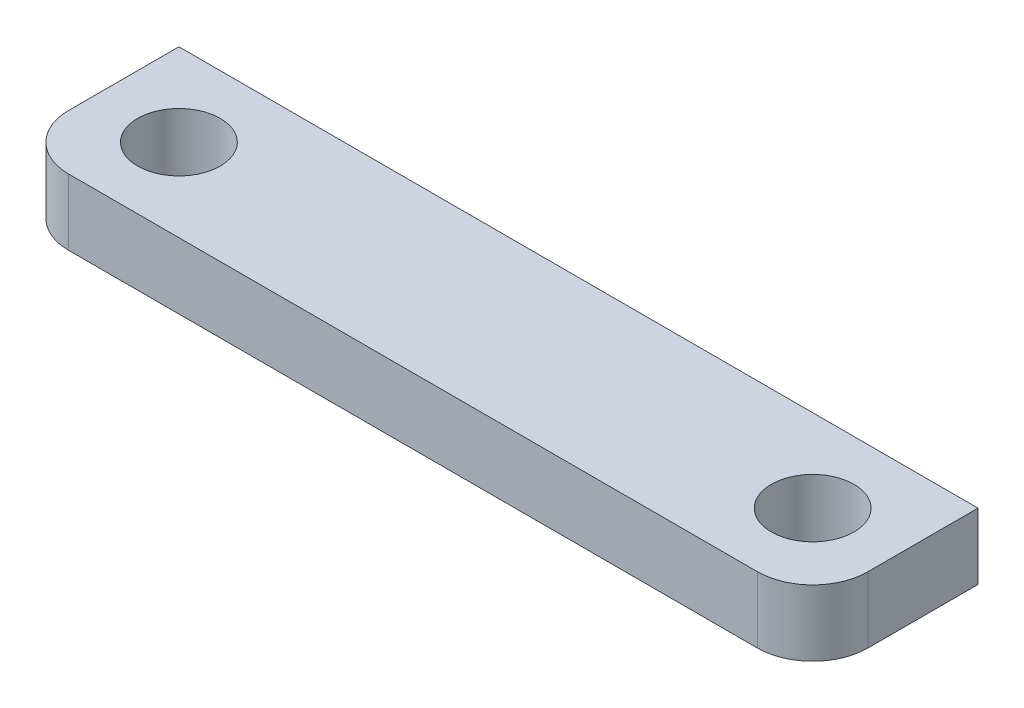
ISO-10303-21;
HEADER;
FILE_DESCRIPTION(('STEP AP214'),'2;1');
FILE_NAME('part.step','',(''),(''),'','','');
FILE_SCHEMA(('AUTOMOTIVE_DESIGN { 1 0 10303 214 1 1 1 1 }'));
ENDSEC;
DATA;
#1=APPLICATION_CONTEXT('core data for automotive mechanical design processes');
#2=APPLICATION_PROTOCOL_DEFINITION('international standard','automotive_design',2000,#1);
#3=PRODUCT_CONTEXT('',#1,'mechanical');
#4=PRODUCT('Part','Part','',(#3));
#5=PRODUCT_RELATED_PRODUCT_CATEGORY('part','',(#4));
#6=PRODUCT_DEFINITION_FORMATION('','',#4);
#7=PRODUCT_DEFINITION_CONTEXT('part definition',#1,'design');
#8=PRODUCT_DEFINITION('design','',#6,#7);
#9=PRODUCT_DEFINITION_SHAPE('','',#8);
#10=(LENGTH_UNIT() NAMED_UNIT(*) SI_UNIT(.MILLI.,.METRE.));
#11=(NAMED_UNIT(*) PLANE_ANGLE_UNIT() SI_UNIT($,.RADIAN.));
#12=(NAMED_UNIT(*) SI_UNIT($,.STERADIAN.) SOLID_ANGLE_UNIT());
#13=UNCERTAINTY_MEASURE_WITH_UNIT(LENGTH_MEASURE(1.E-05),#10,'distance_accuracy_value','');
#14=(GEOMETRIC_REPRESENTATION_CONTEXT(3) GLOBAL_UNCERTAINTY_ASSIGNED_CONTEXT((#13)) GLOBAL_UNIT_ASSIGNED_CONTEXT((#10,
#11,#12)) REPRESENTATION_CONTEXT('',''));
#15=CARTESIAN_POINT('',(0.,0.,0.));
#16=DIRECTION('',(0.,0.,1.));
#17=DIRECTION('',(1.,0.,0.));
#18=AXIS2_PLACEMENT_3D('',#15,#16,#17);
#19=CARTESIAN_POINT('',(29.,2.4,0.));
#20=DIRECTION('',(0.,0.,1.));
#21=DIRECTION('',(1.,0.,0.));
#22=AXIS2_PLACEMENT_3D('',#19,#20,#21);
#23=PLANE('',#22);
#24=DIRECTION('',(-1.,0.,0.));
#25=VECTOR('',#24,1.);
#26=CARTESIAN_POINT('',(29.,0.,0.));
#27=LINE('',#26,#25);
#28=CARTESIAN_POINT('',(29.,0.,0.));
#29=VERTEX_POINT('',#28);
#30=CARTESIAN_POINT('',(0.,0.,0.));
#31=VERTEX_POINT('',#30);
#32=EDGE_CURVE('E106',#29,#31,#27,.T.);
#33=ORIENTED_EDGE('',*,*,#32,.T.);
#34=DIRECTION('',(0.,-1.,0.));
#35=VECTOR('',#34,1.);
#36=CARTESIAN_POINT('',(0.,2.4,0.));
#37=LINE('',#36,#35);
#38=CARTESIAN_POINT('',(0.,2.4,0.));
#39=VERTEX_POINT('',#38);
#40=EDGE_CURVE('E89',#39,#31,#37,.T.);
#41=ORIENTED_EDGE('',*,*,#40,.F.);
#42=DIRECTION('',(-1.,0.,0.));
#43=VECTOR('',#42,1.);
#44=CARTESIAN_POINT('',(29.,2.4,0.));
#45=LINE('',#44,#43);
#46=CARTESIAN_POINT('',(29.,2.4,0.));
#47=VERTEX_POINT('',#46);
#48=EDGE_CURVE('E94',#47,#39,#45,.T.);
#49=ORIENTED_EDGE('',*,*,#48,.F.);
#50=DIRECTION('',(0.,-1.,0.));
#51=VECTOR('',#50,1.);
#52=CARTESIAN_POINT('',(29.,2.4,0.));
#53=LINE('',#52,#51);
#54=EDGE_CURVE('E108',#47,#29,#53,.T.);
#55=ORIENTED_EDGE('',*,*,#54,.T.);
#56=EDGE_LOOP('',(#33,#41,#49,#55));
#57=FACE_BOUND('',#56,.T.);
#58=ADVANCED_FACE('F33',(#57),#23,.F.);
#59=CARTESIAN_POINT('',(0.,2.4,0.));
#60=DIRECTION('',(1.,0.,0.));
#61=DIRECTION('',(0.,0.,-1.));
#62=AXIS2_PLACEMENT_3D('',#59,#60,#61);
#63=PLANE('',#62);
#64=DIRECTION('',(0.,0.,1.));
#65=VECTOR('',#64,1.);
#66=CARTESIAN_POINT('',(0.,0.,0.));
#67=LINE('',#66,#65);
#68=CARTESIAN_POINT('',(0.,0.,3.99999999999999));
#69=VERTEX_POINT('',#68);
#70=EDGE_CURVE('E138',#31,#69,#67,.T.);
#71=ORIENTED_EDGE('',*,*,#70,.T.);
#72=DIRECTION('',(0.,-1.,0.));
#73=VECTOR('',#72,1.);
#74=CARTESIAN_POINT('',(0.,2.4,3.99999999999999));
#75=LINE('',#74,#73);
#76=CARTESIAN_POINT('',(0.,2.4,3.99999999999999));
#77=VERTEX_POINT('',#76);
#78=EDGE_CURVE('E11',#69,#77,#75,.F.);
#79=ORIENTED_EDGE('',*,*,#78,.T.);
#80=DIRECTION('',(0.,0.,1.));
#81=VECTOR('',#80,1.);
#82=CARTESIAN_POINT('',(0.,2.4,0.));
#83=LINE('',#82,#81);
#84=EDGE_CURVE('E85',#39,#77,#83,.T.);
#85=ORIENTED_EDGE('',*,*,#84,.F.);
#86=ORIENTED_EDGE('',*,*,#40,.T.);
#87=EDGE_LOOP('',(#71,#79,#85,#86));
#88=FACE_BOUND('',#87,.T.);
#89=ADVANCED_FACE('F87',(#88),#63,.F.);
#90=CARTESIAN_POINT('',(0.,2.4,5.99999999999999));
#91=DIRECTION('',(0.,0.,-1.));
#92=DIRECTION('',(-1.,0.,0.));
#93=AXIS2_PLACEMENT_3D('',#90,#91,#92);
#94=PLANE('',#93);
#95=DIRECTION('',(1.,0.,0.));
#96=VECTOR('',#95,1.);
#97=CARTESIAN_POINT('',(0.,0.,5.99999999999999));
#98=LINE('',#97,#96);
#99=CARTESIAN_POINT('',(2.,0.,5.99999999999999));
#100=VERTEX_POINT('',#99);
#101=CARTESIAN_POINT('',(27.,0.,5.99999999999999));
#102=VERTEX_POINT('',#101);
#103=EDGE_CURVE('E135',#100,#102,#98,.T.);
#104=ORIENTED_EDGE('',*,*,#103,.T.);
#105=DIRECTION('',(0.,-1.,0.));
#106=VECTOR('',#105,1.);
#107=CARTESIAN_POINT('',(27.,2.4,5.99999999999999));
#108=LINE('',#107,#106);
#109=CARTESIAN_POINT('',(27.,2.4,5.99999999999999));
#110=VERTEX_POINT('',#109);
#111=EDGE_CURVE('E54',#102,#110,#108,.F.);
#112=ORIENTED_EDGE('',*,*,#111,.T.);
#113=DIRECTION('',(1.,0.,0.));
#114=VECTOR('',#113,1.);
#115=CARTESIAN_POINT('',(0.,2.4,5.99999999999999));
#116=LINE('',#115,#114);
#117=CARTESIAN_POINT('',(2.,2.4,5.99999999999999));
#118=VERTEX_POINT('',#117);
#119=EDGE_CURVE('E93',#118,#110,#116,.T.);
#120=ORIENTED_EDGE('',*,*,#119,.F.);
#121=DIRECTION('',(0.,-1.,0.));
#122=VECTOR('',#121,1.);
#123=CARTESIAN_POINT('',(2.00000000000001,2.4,5.99999999999999));
#124=LINE('',#123,#122);
#125=EDGE_CURVE('E119',#118,#100,#124,.T.);
#126=ORIENTED_EDGE('',*,*,#125,.T.);
#127=EDGE_LOOP('',(#104,#112,#120,#126));
#128=FACE_BOUND('',#127,.T.);
#129=ADVANCED_FACE('F136',(#128),#94,.F.);
#130=CARTESIAN_POINT('',(29.,2.4,5.99999999999999));
#131=DIRECTION('',(-1.,0.,0.));
#132=DIRECTION('',(0.,0.,1.));
#133=AXIS2_PLACEMENT_3D('',#130,#131,#132);
#134=PLANE('',#133);
#135=DIRECTION('',(0.,0.,-1.));
#136=VECTOR('',#135,1.);
#137=CARTESIAN_POINT('',(29.,2.4,5.99999999999999));
#138=LINE('',#137,#136);
#139=CARTESIAN_POINT('',(29.,2.4,3.99999999999999));
#140=VERTEX_POINT('',#139);
#141=EDGE_CURVE('E99',#140,#47,#138,.T.);
#142=ORIENTED_EDGE('',*,*,#141,.F.);
#143=DIRECTION('',(0.,-1.,0.));
#144=VECTOR('',#143,1.);
#145=CARTESIAN_POINT('',(29.,2.4,3.99999999999999));
#146=LINE('',#145,#144);
#147=CARTESIAN_POINT('',(29.,0.,3.99999999999999));
#148=VERTEX_POINT('',#147);
#149=EDGE_CURVE('E107',#140,#148,#146,.T.);
#150=ORIENTED_EDGE('',*,*,#149,.T.);
#151=DIRECTION('',(0.,0.,-1.));
#152=VECTOR('',#151,1.);
#153=CARTESIAN_POINT('',(29.,0.,5.99999999999999));
#154=LINE('',#153,#152);
#155=EDGE_CURVE('E103',#148,#29,#154,.T.);
#156=ORIENTED_EDGE('',*,*,#155,.T.);
#157=ORIENTED_EDGE('',*,*,#54,.F.);
#158=EDGE_LOOP('',(#142,#150,#156,#157));
#159=FACE_BOUND('',#158,.T.);
#160=ADVANCED_FACE('F128',(#159),#134,.F.);
#161=CARTESIAN_POINT('',(0.,2.4,0.));
#162=DIRECTION('',(0.,1.,0.));
#163=DIRECTION('',(0.,0.,1.));
#164=AXIS2_PLACEMENT_3D('',#161,#162,#163);
#165=PLANE('',#164);
#166=CARTESIAN_POINT('',(3.,2.4,3.));
#167=DIRECTION('',(0.,1.,0.));
#168=DIRECTION('',(0.,0.,1.));
#169=AXIS2_PLACEMENT_3D('',#166,#167,#168);
#170=CIRCLE('',#169,1.5);
#171=CARTESIAN_POINT('',(3.,2.4,4.5));
#172=VERTEX_POINT('',#171);
#173=EDGE_CURVE('E148',#172,#172,#170,.T.);
#174=ORIENTED_EDGE('',*,*,#173,.F.);
#175=EDGE_LOOP('',(#174));
#176=FACE_BOUND('',#175,.T.);
#177=CARTESIAN_POINT('',(26.,2.4,2.99999999999999));
#178=DIRECTION('',(0.,1.,0.));
#179=DIRECTION('',(0.,0.,1.));
#180=AXIS2_PLACEMENT_3D('',#177,#178,#179);
#181=CIRCLE('',#180,1.5);
#182=CARTESIAN_POINT('',(26.,2.4,4.49999999999999));
#183=VERTEX_POINT('',#182);
#184=EDGE_CURVE('E149',#183,#183,#181,.T.);
#185=ORIENTED_EDGE('',*,*,#184,.F.);
#186=EDGE_LOOP('',(#185));
#187=FACE_BOUND('',#186,.T.);
#188=ORIENTED_EDGE('',*,*,#119,.T.);
#189=CARTESIAN_POINT('',(27.,2.4,3.99999999999999));
#190=DIRECTION('',(0.,1.,0.));
#191=DIRECTION('',(0.,0.,1.));
#192=AXIS2_PLACEMENT_3D('',#189,#190,#191);
#193=CIRCLE('',#192,2.);
#194=EDGE_CURVE('E41',#110,#140,#193,.T.);
#195=ORIENTED_EDGE('',*,*,#194,.T.);
#196=ORIENTED_EDGE('',*,*,#141,.T.);
#197=ORIENTED_EDGE('',*,*,#48,.T.);
#198=ORIENTED_EDGE('',*,*,#84,.T.);
#199=CARTESIAN_POINT('',(2.00000000000001,2.4,3.99999999999999));
#200=DIRECTION('',(0.,1.,0.));
#201=DIRECTION('',(0.,0.,1.));
#202=AXIS2_PLACEMENT_3D('',#199,#200,#201);
#203=CIRCLE('',#202,2.);
#204=EDGE_CURVE('E123',#77,#118,#203,.T.);
#205=ORIENTED_EDGE('',*,*,#204,.T.);
#206=EDGE_LOOP('',(#188,#195,#196,#197,#198,#205));
#207=FACE_BOUND('',#206,.T.);
#208=ADVANCED_FACE('F97',(#176,#187,#207),#165,.T.);
#209=CARTESIAN_POINT('',(0.,0.,0.));
#210=DIRECTION('',(0.,1.,0.));
#211=DIRECTION('',(0.,0.,1.));
#212=AXIS2_PLACEMENT_3D('',#209,#210,#211);
#213=PLANE('',#212);
#214=CARTESIAN_POINT('',(3.,0.,3.));
#215=DIRECTION('',(0.,1.,0.));
#216=DIRECTION('',(0.,0.,1.));
#217=AXIS2_PLACEMENT_3D('',#214,#215,#216);
#218=CIRCLE('',#217,1.5);
#219=CARTESIAN_POINT('',(3.,0.,4.5));
#220=VERTEX_POINT('',#219);
#221=EDGE_CURVE('E142',#220,#220,#218,.F.);
#222=ORIENTED_EDGE('',*,*,#221,.F.);
#223=EDGE_LOOP('',(#222));
#224=FACE_BOUND('',#223,.T.);
#225=CARTESIAN_POINT('',(26.,0.,2.99999999999999));
#226=DIRECTION('',(0.,1.,0.));
#227=DIRECTION('',(0.,0.,1.));
#228=AXIS2_PLACEMENT_3D('',#225,#226,#227);
#229=CIRCLE('',#228,1.5);
#230=CARTESIAN_POINT('',(26.,0.,4.49999999999999));
#231=VERTEX_POINT('',#230);
#232=EDGE_CURVE('E145',#231,#231,#229,.F.);
#233=ORIENTED_EDGE('',*,*,#232,.F.);
#234=EDGE_LOOP('',(#233));
#235=FACE_BOUND('',#234,.T.);
#236=ORIENTED_EDGE('',*,*,#155,.F.);
#237=CARTESIAN_POINT('',(27.,0.,3.99999999999999));
#238=DIRECTION('',(0.,1.,0.));
#239=DIRECTION('',(0.,0.,1.));
#240=AXIS2_PLACEMENT_3D('',#237,#238,#239);
#241=CIRCLE('',#240,2.);
#242=EDGE_CURVE('E117',#148,#102,#241,.F.);
#243=ORIENTED_EDGE('',*,*,#242,.T.);
#244=ORIENTED_EDGE('',*,*,#103,.F.);
#245=CARTESIAN_POINT('',(2.00000000000001,0.,3.99999999999999));
#246=DIRECTION('',(0.,1.,0.));
#247=DIRECTION('',(0.,0.,1.));
#248=AXIS2_PLACEMENT_3D('',#245,#246,#247);
#249=CIRCLE('',#248,2.);
#250=EDGE_CURVE('E111',#100,#69,#249,.F.);
#251=ORIENTED_EDGE('',*,*,#250,.T.);
#252=ORIENTED_EDGE('',*,*,#70,.F.);
#253=ORIENTED_EDGE('',*,*,#32,.F.);
#254=EDGE_LOOP('',(#236,#243,#244,#251,#252,#253));
#255=FACE_BOUND('',#254,.T.);
#256=ADVANCED_FACE('F134',(#224,#235,#255),#213,.F.);
#257=CARTESIAN_POINT('',(26.,-4.24264068711929,2.99999999999999));
#258=DIRECTION('',(0.,1.,0.));
#259=DIRECTION('',(0.,0.,1.));
#260=AXIS2_PLACEMENT_3D('',#257,#258,#259);
#261=CYLINDRICAL_SURFACE('',#260,1.5);
#262=ORIENTED_EDGE('',*,*,#232,.T.);
#263=EDGE_LOOP('',(#262));
#264=FACE_BOUND('',#263,.T.);
#265=ORIENTED_EDGE('',*,*,#184,.T.);
#266=EDGE_LOOP('',(#265));
#267=FACE_BOUND('',#266,.T.);
#268=ADVANCED_FACE('F164',(#264,#267),#261,.F.);
#269=CARTESIAN_POINT('',(3.,-4.24264068711929,3.));
#270=DIRECTION('',(0.,1.,0.));
#271=DIRECTION('',(0.,0.,1.));
#272=AXIS2_PLACEMENT_3D('',#269,#270,#271);
#273=CYLINDRICAL_SURFACE('',#272,1.5);
#274=ORIENTED_EDGE('',*,*,#221,.T.);
#275=EDGE_LOOP('',(#274));
#276=FACE_BOUND('',#275,.T.);
#277=ORIENTED_EDGE('',*,*,#173,.T.);
#278=EDGE_LOOP('',(#277));
#279=FACE_BOUND('',#278,.T.);
#280=ADVANCED_FACE('F157',(#276,#279),#273,.F.);
#281=CARTESIAN_POINT('',(27.,2.4,3.99999999999999));
#282=DIRECTION('',(0.,-1.,0.));
#283=DIRECTION('',(0.,0.,-1.));
#284=AXIS2_PLACEMENT_3D('',#281,#282,#283);
#285=CYLINDRICAL_SURFACE('',#284,2.);
#286=ORIENTED_EDGE('',*,*,#194,.F.);
#287=ORIENTED_EDGE('',*,*,#111,.F.);
#288=ORIENTED_EDGE('',*,*,#242,.F.);
#289=ORIENTED_EDGE('',*,*,#149,.F.);
#290=EDGE_LOOP('',(#286,#287,#288,#289));
#291=FACE_BOUND('',#290,.T.);
#292=ADVANCED_FACE('F131',(#291),#285,.T.);
#293=CARTESIAN_POINT('',(2.00000000000001,2.4,3.99999999999999));
#294=DIRECTION('',(0.,-1.,0.));
#295=DIRECTION('',(0.,0.,-1.));
#296=AXIS2_PLACEMENT_3D('',#293,#294,#295);
#297=CYLINDRICAL_SURFACE('',#296,2.);
#298=ORIENTED_EDGE('',*,*,#204,.F.);
#299=ORIENTED_EDGE('',*,*,#78,.F.);
#300=ORIENTED_EDGE('',*,*,#250,.F.);
#301=ORIENTED_EDGE('',*,*,#125,.F.);
#302=EDGE_LOOP('',(#298,#299,#300,#301));
#303=FACE_BOUND('',#302,.T.);
#304=ADVANCED_FACE('F35',(#303),#297,.T.);
#305=CLOSED_SHELL('',(#58,#89,#129,#160,#208,#256,#268,#280,#292,#304));
#306=MANIFOLD_SOLID_BREP('B2',#305);
#307=ADVANCED_BREP_SHAPE_REPRESENTATION('',(#18,#306),#14);
#308=SHAPE_DEFINITION_REPRESENTATION(#9,#307);
ENDSEC;
END-ISO-10303-21;
